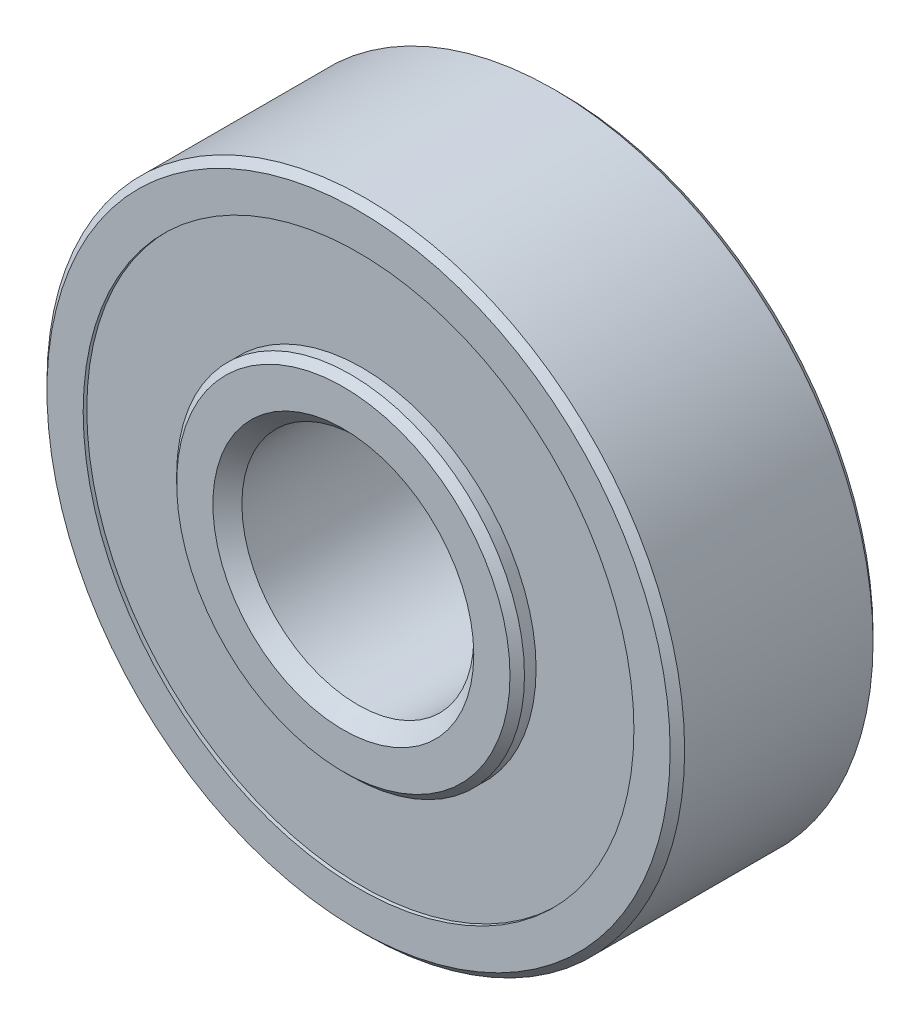
ISO-10303-21;
HEADER;
FILE_DESCRIPTION(('STEP AP214'),'2;1');
FILE_NAME('part.step','',(''),(''),'','','');
FILE_SCHEMA(('AUTOMOTIVE_DESIGN { 1 0 10303 214 1 1 1 1 }'));
ENDSEC;
DATA;
#1=APPLICATION_CONTEXT('core data for automotive mechanical design processes');
#2=APPLICATION_PROTOCOL_DEFINITION('international standard','automotive_design',2000,#1);
#3=PRODUCT_CONTEXT('',#1,'mechanical');
#4=PRODUCT('Part','Part','',(#3));
#5=PRODUCT_RELATED_PRODUCT_CATEGORY('part','',(#4));
#6=PRODUCT_DEFINITION_FORMATION('','',#4);
#7=PRODUCT_DEFINITION_CONTEXT('part definition',#1,'design');
#8=PRODUCT_DEFINITION('design','',#6,#7);
#9=PRODUCT_DEFINITION_SHAPE('','',#8);
#10=(LENGTH_UNIT() NAMED_UNIT(*) SI_UNIT(.MILLI.,.METRE.));
#11=(NAMED_UNIT(*) PLANE_ANGLE_UNIT() SI_UNIT($,.RADIAN.));
#12=(NAMED_UNIT(*) SI_UNIT($,.STERADIAN.) SOLID_ANGLE_UNIT());
#13=UNCERTAINTY_MEASURE_WITH_UNIT(LENGTH_MEASURE(1.E-05),#10,'distance_accuracy_value','');
#14=(GEOMETRIC_REPRESENTATION_CONTEXT(3) GLOBAL_UNCERTAINTY_ASSIGNED_CONTEXT((#13)) GLOBAL_UNIT_ASSIGNED_CONTEXT((#10,
#11,#12)) REPRESENTATION_CONTEXT('',''));
#15=CARTESIAN_POINT('',(0.,0.,0.));
#16=DIRECTION('',(0.,0.,1.));
#17=DIRECTION('',(1.,0.,0.));
#18=AXIS2_PLACEMENT_3D('',#15,#16,#17);
#19=CARTESIAN_POINT('',(0.,0.,3.5));
#20=DIRECTION('',(0.,0.,-1.));
#21=DIRECTION('',(-1.,0.,0.));
#22=AXIS2_PLACEMENT_3D('',#19,#20,#21);
#23=CYLINDRICAL_SURFACE('',#22,9.5);
#24=CARTESIAN_POINT('',(0.,0.,-3.5));
#25=DIRECTION('',(0.,0.,1.));
#26=DIRECTION('',(1.,0.,0.));
#27=AXIS2_PLACEMENT_3D('',#24,#25,#26);
#28=CIRCLE('',#27,9.5);
#29=CARTESIAN_POINT('',(9.5,0.,-3.5));
#30=VERTEX_POINT('',#29);
#31=EDGE_CURVE('E81',#30,#30,#28,.T.);
#32=ORIENTED_EDGE('',*,*,#31,.F.);
#33=EDGE_LOOP('',(#32));
#34=FACE_BOUND('',#33,.T.);
#35=CARTESIAN_POINT('',(0.,0.,-3.375));
#36=DIRECTION('',(0.,0.,1.));
#37=DIRECTION('',(1.,0.,0.));
#38=AXIS2_PLACEMENT_3D('',#35,#36,#37);
#39=CIRCLE('',#38,9.5);
#40=CARTESIAN_POINT('',(9.5,0.,-3.375));
#41=VERTEX_POINT('',#40);
#42=EDGE_CURVE('E87',#41,#41,#39,.T.);
#43=ORIENTED_EDGE('',*,*,#42,.T.);
#44=EDGE_LOOP('',(#43));
#45=FACE_BOUND('',#44,.T.);
#46=ADVANCED_FACE('F33',(#34,#45),#23,.F.);
#47=CARTESIAN_POINT('',(0.,0.,3.375));
#48=DIRECTION('',(0.,0.,1.));
#49=DIRECTION('',(1.,0.,0.));
#50=AXIS2_PLACEMENT_3D('',#47,#48,#49);
#51=CIRCLE('',#50,9.5);
#52=CARTESIAN_POINT('',(9.5,0.,3.375));
#53=VERTEX_POINT('',#52);
#54=EDGE_CURVE('E77',#53,#53,#51,.T.);
#55=ORIENTED_EDGE('',*,*,#54,.F.);
#56=EDGE_LOOP('',(#55));
#57=FACE_BOUND('',#56,.T.);
#58=CARTESIAN_POINT('',(0.,0.,3.5));
#59=DIRECTION('',(0.,0.,1.));
#60=DIRECTION('',(1.,0.,0.));
#61=AXIS2_PLACEMENT_3D('',#58,#59,#60);
#62=CIRCLE('',#61,9.5);
#63=CARTESIAN_POINT('',(9.5,0.,3.5));
#64=VERTEX_POINT('',#63);
#65=EDGE_CURVE('E80',#64,#64,#62,.T.);
#66=ORIENTED_EDGE('',*,*,#65,.T.);
#67=EDGE_LOOP('',(#66));
#68=FACE_BOUND('',#67,.T.);
#69=ADVANCED_FACE('F106',(#57,#68),#23,.F.);
#70=CARTESIAN_POINT('',(0.,0.,3.5));
#71=DIRECTION('',(0.,0.,-1.));
#72=DIRECTION('',(-1.,0.,0.));
#73=AXIS2_PLACEMENT_3D('',#70,#71,#72);
#74=CYLINDRICAL_SURFACE('',#73,11.);
#75=CARTESIAN_POINT('',(0.,0.,-3.25));
#76=DIRECTION('',(0.,0.,1.));
#77=DIRECTION('',(1.,0.,0.));
#78=AXIS2_PLACEMENT_3D('',#75,#76,#77);
#79=CIRCLE('',#78,11.);
#80=CARTESIAN_POINT('',(11.,0.,-3.25));
#81=VERTEX_POINT('',#80);
#82=EDGE_CURVE('E59',#81,#81,#79,.T.);
#83=ORIENTED_EDGE('',*,*,#82,.T.);
#84=EDGE_LOOP('',(#83));
#85=FACE_BOUND('',#84,.T.);
#86=CARTESIAN_POINT('',(0.,0.,3.25));
#87=DIRECTION('',(0.,0.,1.));
#88=DIRECTION('',(1.,0.,0.));
#89=AXIS2_PLACEMENT_3D('',#86,#87,#88);
#90=CIRCLE('',#89,11.);
#91=CARTESIAN_POINT('',(11.,0.,3.25));
#92=VERTEX_POINT('',#91);
#93=EDGE_CURVE('E62',#92,#92,#90,.F.);
#94=ORIENTED_EDGE('',*,*,#93,.T.);
#95=EDGE_LOOP('',(#94));
#96=FACE_BOUND('',#95,.T.);
#97=ADVANCED_FACE('F112',(#85,#96),#74,.T.);
#98=CARTESIAN_POINT('',(0.,0.,3.5));
#99=DIRECTION('',(0.,0.,1.));
#100=DIRECTION('',(1.,0.,0.));
#101=AXIS2_PLACEMENT_3D('',#98,#99,#100);
#102=PLANE('',#101);
#103=CARTESIAN_POINT('',(0.,0.,3.5));
#104=DIRECTION('',(0.,0.,1.));
#105=DIRECTION('',(1.,0.,0.));
#106=AXIS2_PLACEMENT_3D('',#103,#104,#105);
#107=CIRCLE('',#106,10.75);
#108=CARTESIAN_POINT('',(10.75,0.,3.5));
#109=VERTEX_POINT('',#108);
#110=EDGE_CURVE('E53',#109,#109,#107,.T.);
#111=ORIENTED_EDGE('',*,*,#110,.T.);
#112=EDGE_LOOP('',(#111));
#113=FACE_BOUND('',#112,.T.);
#114=ORIENTED_EDGE('',*,*,#65,.F.);
#115=EDGE_LOOP('',(#114));
#116=FACE_BOUND('',#115,.T.);
#117=ADVANCED_FACE('F172',(#113,#116),#102,.T.);
#118=CARTESIAN_POINT('',(0.,0.,-3.5));
#119=DIRECTION('',(0.,0.,1.));
#120=DIRECTION('',(1.,0.,0.));
#121=AXIS2_PLACEMENT_3D('',#118,#119,#120);
#122=PLANE('',#121);
#123=CARTESIAN_POINT('',(0.,0.,-3.5));
#124=DIRECTION('',(0.,0.,1.));
#125=DIRECTION('',(1.,0.,0.));
#126=AXIS2_PLACEMENT_3D('',#123,#124,#125);
#127=CIRCLE('',#126,10.75);
#128=CARTESIAN_POINT('',(10.75,0.,-3.5));
#129=VERTEX_POINT('',#128);
#130=EDGE_CURVE('E56',#129,#129,#127,.F.);
#131=ORIENTED_EDGE('',*,*,#130,.T.);
#132=EDGE_LOOP('',(#131));
#133=FACE_BOUND('',#132,.T.);
#134=ORIENTED_EDGE('',*,*,#31,.T.);
#135=EDGE_LOOP('',(#134));
#136=FACE_BOUND('',#135,.T.);
#137=ADVANCED_FACE('F169',(#133,#136),#122,.F.);
#138=CARTESIAN_POINT('',(0.,0.,3.375));
#139=DIRECTION('',(0.,0.,1.));
#140=DIRECTION('',(1.,0.,0.));
#141=AXIS2_PLACEMENT_3D('',#138,#139,#140);
#142=PLANE('',#141);
#143=CARTESIAN_POINT('',(0.,0.,3.375));
#144=DIRECTION('',(0.,0.,1.));
#145=DIRECTION('',(1.,0.,0.));
#146=AXIS2_PLACEMENT_3D('',#143,#144,#145);
#147=CIRCLE('',#146,6.);
#148=CARTESIAN_POINT('',(6.,0.,3.375));
#149=VERTEX_POINT('',#148);
#150=EDGE_CURVE('E84',#149,#149,#147,.T.);
#151=ORIENTED_EDGE('',*,*,#150,.F.);
#152=EDGE_LOOP('',(#151));
#153=FACE_BOUND('',#152,.T.);
#154=ORIENTED_EDGE('',*,*,#54,.T.);
#155=EDGE_LOOP('',(#154));
#156=FACE_BOUND('',#155,.T.);
#157=ADVANCED_FACE('F101',(#153,#156),#142,.T.);
#158=CARTESIAN_POINT('',(0.,0.,-3.375));
#159=DIRECTION('',(0.,0.,1.));
#160=DIRECTION('',(1.,0.,0.));
#161=AXIS2_PLACEMENT_3D('',#158,#159,#160);
#162=PLANE('',#161);
#163=CARTESIAN_POINT('',(0.,0.,-3.375));
#164=DIRECTION('',(0.,0.,1.));
#165=DIRECTION('',(1.,0.,0.));
#166=AXIS2_PLACEMENT_3D('',#163,#164,#165);
#167=CIRCLE('',#166,6.);
#168=CARTESIAN_POINT('',(6.,0.,-3.375));
#169=VERTEX_POINT('',#168);
#170=EDGE_CURVE('E90',#169,#169,#167,.F.);
#171=ORIENTED_EDGE('',*,*,#170,.F.);
#172=EDGE_LOOP('',(#171));
#173=FACE_BOUND('',#172,.T.);
#174=ORIENTED_EDGE('',*,*,#42,.F.);
#175=EDGE_LOOP('',(#174));
#176=FACE_BOUND('',#175,.T.);
#177=ADVANCED_FACE('F98',(#173,#176),#162,.F.);
#178=CARTESIAN_POINT('',(0.,0.,4.025));
#179=DIRECTION('',(0.,0.,-1.));
#180=DIRECTION('',(-1.,0.,0.));
#181=AXIS2_PLACEMENT_3D('',#178,#179,#180);
#182=CYLINDRICAL_SURFACE('',#181,6.);
#183=CARTESIAN_POINT('',(0.,0.,-3.77499999999999));
#184=DIRECTION('',(0.,0.,1.));
#185=DIRECTION('',(1.,0.,0.));
#186=AXIS2_PLACEMENT_3D('',#183,#184,#185);
#187=CIRCLE('',#186,6.);
#188=CARTESIAN_POINT('',(6.,0.,-3.77499999999999));
#189=VERTEX_POINT('',#188);
#190=EDGE_CURVE('E40',#189,#189,#187,.T.);
#191=ORIENTED_EDGE('',*,*,#190,.T.);
#192=EDGE_LOOP('',(#191));
#193=FACE_BOUND('',#192,.T.);
#194=ORIENTED_EDGE('',*,*,#170,.T.);
#195=EDGE_LOOP('',(#194));
#196=FACE_BOUND('',#195,.T.);
#197=ADVANCED_FACE('F96',(#193,#196),#182,.T.);
#198=CARTESIAN_POINT('',(0.,0.,4.025));
#199=DIRECTION('',(0.,0.,-1.));
#200=DIRECTION('',(-1.,0.,0.));
#201=AXIS2_PLACEMENT_3D('',#198,#199,#200);
#202=CYLINDRICAL_SURFACE('',#201,4.);
#203=CARTESIAN_POINT('',(0.,0.,-3.52499999999999));
#204=DIRECTION('',(0.,0.,1.));
#205=DIRECTION('',(1.,0.,0.));
#206=AXIS2_PLACEMENT_3D('',#203,#204,#205);
#207=CIRCLE('',#206,4.);
#208=CARTESIAN_POINT('',(4.,0.,-3.52499999999999));
#209=VERTEX_POINT('',#208);
#210=EDGE_CURVE('E68',#209,#209,#207,.F.);
#211=ORIENTED_EDGE('',*,*,#210,.T.);
#212=EDGE_LOOP('',(#211));
#213=FACE_BOUND('',#212,.T.);
#214=CARTESIAN_POINT('',(0.,0.,3.525));
#215=DIRECTION('',(0.,0.,1.));
#216=DIRECTION('',(1.,0.,0.));
#217=AXIS2_PLACEMENT_3D('',#214,#215,#216);
#218=CIRCLE('',#217,4.);
#219=CARTESIAN_POINT('',(4.,0.,3.525));
#220=VERTEX_POINT('',#219);
#221=EDGE_CURVE('E71',#220,#220,#218,.T.);
#222=ORIENTED_EDGE('',*,*,#221,.T.);
#223=EDGE_LOOP('',(#222));
#224=FACE_BOUND('',#223,.T.);
#225=ADVANCED_FACE('F154',(#213,#224),#202,.F.);
#226=CARTESIAN_POINT('',(0.,0.,3.77500000000001));
#227=DIRECTION('',(0.,0.,1.));
#228=DIRECTION('',(1.,0.,0.));
#229=AXIS2_PLACEMENT_3D('',#226,#227,#228);
#230=CIRCLE('',#229,6.);
#231=CARTESIAN_POINT('',(6.,0.,3.77500000000001));
#232=VERTEX_POINT('',#231);
#233=EDGE_CURVE('E44',#232,#232,#230,.F.);
#234=ORIENTED_EDGE('',*,*,#233,.T.);
#235=EDGE_LOOP('',(#234));
#236=FACE_BOUND('',#235,.T.);
#237=ORIENTED_EDGE('',*,*,#150,.T.);
#238=EDGE_LOOP('',(#237));
#239=FACE_BOUND('',#238,.T.);
#240=ADVANCED_FACE('F148',(#236,#239),#182,.T.);
#241=CARTESIAN_POINT('',(0.,0.,4.025));
#242=DIRECTION('',(0.,0.,1.));
#243=DIRECTION('',(1.,0.,0.));
#244=AXIS2_PLACEMENT_3D('',#241,#242,#243);
#245=PLANE('',#244);
#246=CARTESIAN_POINT('',(0.,0.,4.025));
#247=DIRECTION('',(0.,0.,1.));
#248=DIRECTION('',(1.,0.,0.));
#249=AXIS2_PLACEMENT_3D('',#246,#247,#248);
#250=CIRCLE('',#249,5.75000000000001);
#251=CARTESIAN_POINT('',(5.75000000000001,0.,4.025));
#252=VERTEX_POINT('',#251);
#253=EDGE_CURVE('E48',#252,#252,#250,.T.);
#254=ORIENTED_EDGE('',*,*,#253,.T.);
#255=EDGE_LOOP('',(#254));
#256=FACE_BOUND('',#255,.T.);
#257=CARTESIAN_POINT('',(0.,0.,4.025));
#258=DIRECTION('',(0.,0.,1.));
#259=DIRECTION('',(1.,0.,0.));
#260=AXIS2_PLACEMENT_3D('',#257,#258,#259);
#261=CIRCLE('',#260,4.50000000000001);
#262=CARTESIAN_POINT('',(4.50000000000001,0.,4.025));
#263=VERTEX_POINT('',#262);
#264=EDGE_CURVE('E65',#263,#263,#261,.F.);
#265=ORIENTED_EDGE('',*,*,#264,.T.);
#266=EDGE_LOOP('',(#265));
#267=FACE_BOUND('',#266,.T.);
#268=ADVANCED_FACE('F145',(#256,#267),#245,.T.);
#269=CARTESIAN_POINT('',(0.,0.,-4.025));
#270=DIRECTION('',(0.,0.,1.));
#271=DIRECTION('',(1.,0.,0.));
#272=AXIS2_PLACEMENT_3D('',#269,#270,#271);
#273=PLANE('',#272);
#274=CARTESIAN_POINT('',(0.,0.,-4.025));
#275=DIRECTION('',(0.,0.,1.));
#276=DIRECTION('',(1.,0.,0.));
#277=AXIS2_PLACEMENT_3D('',#274,#275,#276);
#278=CIRCLE('',#277,5.74999999999999);
#279=CARTESIAN_POINT('',(5.74999999999999,0.,-4.025));
#280=VERTEX_POINT('',#279);
#281=EDGE_CURVE('E10',#280,#280,#278,.F.);
#282=ORIENTED_EDGE('',*,*,#281,.T.);
#283=EDGE_LOOP('',(#282));
#284=FACE_BOUND('',#283,.T.);
#285=CARTESIAN_POINT('',(0.,0.,-4.025));
#286=DIRECTION('',(0.,0.,1.));
#287=DIRECTION('',(1.,0.,0.));
#288=AXIS2_PLACEMENT_3D('',#285,#286,#287);
#289=CIRCLE('',#288,4.5);
#290=CARTESIAN_POINT('',(4.5,0.,-4.025));
#291=VERTEX_POINT('',#290);
#292=EDGE_CURVE('E74',#291,#291,#289,.T.);
#293=ORIENTED_EDGE('',*,*,#292,.T.);
#294=EDGE_LOOP('',(#293));
#295=FACE_BOUND('',#294,.T.);
#296=ADVANCED_FACE('F122',(#284,#295),#273,.F.);
#297=CARTESIAN_POINT('',(0.,0.,-4.025));
#298=DIRECTION('',(0.,0.,-1.));
#299=DIRECTION('',(-1.,0.,0.));
#300=AXIS2_PLACEMENT_3D('',#297,#298,#299);
#301=CONICAL_SURFACE('',#300,4.5,0.785398163397445);
#302=ORIENTED_EDGE('',*,*,#210,.F.);
#303=EDGE_LOOP('',(#302));
#304=FACE_BOUND('',#303,.T.);
#305=ORIENTED_EDGE('',*,*,#292,.F.);
#306=EDGE_LOOP('',(#305));
#307=FACE_BOUND('',#306,.T.);
#308=ADVANCED_FACE('F118',(#304,#307),#301,.F.);
#309=CARTESIAN_POINT('',(0.,0.,3.525));
#310=DIRECTION('',(0.,0.,1.));
#311=DIRECTION('',(1.,0.,0.));
#312=AXIS2_PLACEMENT_3D('',#309,#310,#311);
#313=CONICAL_SURFACE('',#312,4.,0.785398163397452);
#314=ORIENTED_EDGE('',*,*,#264,.F.);
#315=EDGE_LOOP('',(#314));
#316=FACE_BOUND('',#315,.T.);
#317=ORIENTED_EDGE('',*,*,#221,.F.);
#318=EDGE_LOOP('',(#317));
#319=FACE_BOUND('',#318,.T.);
#320=ADVANCED_FACE('F121',(#316,#319),#313,.F.);
#321=CARTESIAN_POINT('',(0.,0.,-3.25));
#322=DIRECTION('',(0.,0.,1.));
#323=DIRECTION('',(1.,0.,0.));
#324=AXIS2_PLACEMENT_3D('',#321,#322,#323);
#325=CONICAL_SURFACE('',#324,11.,0.785398163397448);
#326=ORIENTED_EDGE('',*,*,#130,.F.);
#327=EDGE_LOOP('',(#326));
#328=FACE_BOUND('',#327,.T.);
#329=ORIENTED_EDGE('',*,*,#82,.F.);
#330=EDGE_LOOP('',(#329));
#331=FACE_BOUND('',#330,.T.);
#332=ADVANCED_FACE('F126',(#328,#331),#325,.T.);
#333=CARTESIAN_POINT('',(0.,0.,3.5));
#334=DIRECTION('',(0.,0.,-1.));
#335=DIRECTION('',(-1.,0.,0.));
#336=AXIS2_PLACEMENT_3D('',#333,#334,#335);
#337=CONICAL_SURFACE('',#336,10.75,0.785398163397441);
#338=ORIENTED_EDGE('',*,*,#93,.F.);
#339=EDGE_LOOP('',(#338));
#340=FACE_BOUND('',#339,.T.);
#341=ORIENTED_EDGE('',*,*,#110,.F.);
#342=EDGE_LOOP('',(#341));
#343=FACE_BOUND('',#342,.T.);
#344=ADVANCED_FACE('F130',(#340,#343),#337,.T.);
#345=CARTESIAN_POINT('',(0.,0.,4.025));
#346=DIRECTION('',(0.,0.,-1.));
#347=DIRECTION('',(-1.,0.,0.));
#348=AXIS2_PLACEMENT_3D('',#345,#346,#347);
#349=CONICAL_SURFACE('',#348,5.75000000000001,0.785398163397454);
#350=ORIENTED_EDGE('',*,*,#233,.F.);
#351=EDGE_LOOP('',(#350));
#352=FACE_BOUND('',#351,.T.);
#353=ORIENTED_EDGE('',*,*,#253,.F.);
#354=EDGE_LOOP('',(#353));
#355=FACE_BOUND('',#354,.T.);
#356=ADVANCED_FACE('F133',(#352,#355),#349,.T.);
#357=CARTESIAN_POINT('',(0.,0.,-3.77499999999999));
#358=DIRECTION('',(0.,0.,1.));
#359=DIRECTION('',(1.,0.,0.));
#360=AXIS2_PLACEMENT_3D('',#357,#358,#359);
#361=CONICAL_SURFACE('',#360,6.,0.785398163397455);
#362=ORIENTED_EDGE('',*,*,#281,.F.);
#363=EDGE_LOOP('',(#362));
#364=FACE_BOUND('',#363,.T.);
#365=ORIENTED_EDGE('',*,*,#190,.F.);
#366=EDGE_LOOP('',(#365));
#367=FACE_BOUND('',#366,.T.);
#368=ADVANCED_FACE('F35',(#364,#367),#361,.T.);
#369=CLOSED_SHELL('',(#46,#69,#97,#117,#137,#157,#177,#197,#225,#240,#268,#296,#308,#320,#332,
#344,#356,#368));
#370=MANIFOLD_SOLID_BREP('B2',#369);
#371=ADVANCED_BREP_SHAPE_REPRESENTATION('',(#18,#370),#14);
#372=SHAPE_DEFINITION_REPRESENTATION(#9,#371);
ENDSEC;
END-ISO-10303-21;
